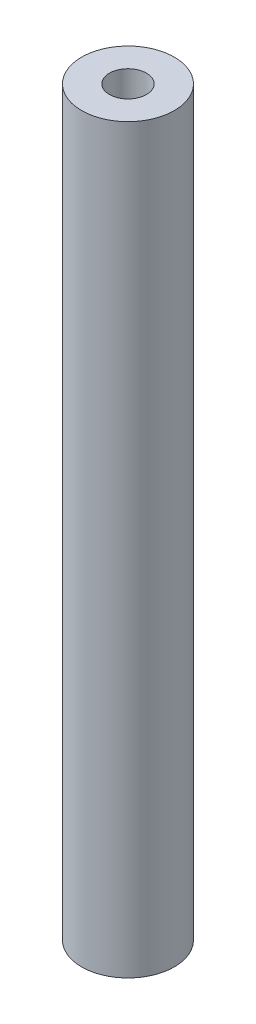
ISO-10303-21;
HEADER;
FILE_DESCRIPTION(('STEP AP214'),'2;1');
FILE_NAME('part.step','',(''),(''),'','','');
FILE_SCHEMA(('AUTOMOTIVE_DESIGN { 1 0 10303 214 1 1 1 1 }'));
ENDSEC;
DATA;
#1=APPLICATION_CONTEXT('core data for automotive mechanical design processes');
#2=APPLICATION_PROTOCOL_DEFINITION('international standard','automotive_design',2000,#1);
#3=PRODUCT_CONTEXT('',#1,'mechanical');
#4=PRODUCT('Part','Part','',(#3));
#5=PRODUCT_RELATED_PRODUCT_CATEGORY('part','',(#4));
#6=PRODUCT_DEFINITION_FORMATION('','',#4);
#7=PRODUCT_DEFINITION_CONTEXT('part definition',#1,'design');
#8=PRODUCT_DEFINITION('design','',#6,#7);
#9=PRODUCT_DEFINITION_SHAPE('','',#8);
#10=(LENGTH_UNIT() NAMED_UNIT(*) SI_UNIT(.MILLI.,.METRE.));
#11=(NAMED_UNIT(*) PLANE_ANGLE_UNIT() SI_UNIT($,.RADIAN.));
#12=(NAMED_UNIT(*) SI_UNIT($,.STERADIAN.) SOLID_ANGLE_UNIT());
#13=UNCERTAINTY_MEASURE_WITH_UNIT(LENGTH_MEASURE(1.E-05),#10,'distance_accuracy_value','');
#14=(GEOMETRIC_REPRESENTATION_CONTEXT(3) GLOBAL_UNCERTAINTY_ASSIGNED_CONTEXT((#13)) GLOBAL_UNIT_ASSIGNED_CONTEXT((#10,
#11,#12)) REPRESENTATION_CONTEXT('',''));
#15=CARTESIAN_POINT('',(0.,0.,0.));
#16=DIRECTION('',(0.,0.,1.));
#17=DIRECTION('',(1.,0.,0.));
#18=AXIS2_PLACEMENT_3D('',#15,#16,#17);
#19=CARTESIAN_POINT('',(0.,40.,0.));
#20=DIRECTION('',(0.,1.,0.));
#21=DIRECTION('',(0.,0.,1.));
#22=AXIS2_PLACEMENT_3D('',#19,#20,#21);
#23=PLANE('',#22);
#24=CARTESIAN_POINT('',(0.,40.,0.));
#25=DIRECTION('',(0.,1.,0.));
#26=DIRECTION('',(0.,0.,1.));
#27=AXIS2_PLACEMENT_3D('',#24,#25,#26);
#28=CIRCLE('',#27,2.5);
#29=CARTESIAN_POINT('',(0.,40.,2.5));
#30=VERTEX_POINT('',#29);
#31=EDGE_CURVE('E10',#30,#30,#28,.T.);
#32=ORIENTED_EDGE('',*,*,#31,.T.);
#33=EDGE_LOOP('',(#32));
#34=FACE_BOUND('',#33,.T.);
#35=CARTESIAN_POINT('',(0.,40.,0.));
#36=DIRECTION('',(0.,1.,0.));
#37=DIRECTION('',(0.,0.,1.));
#38=AXIS2_PLACEMENT_3D('',#35,#36,#37);
#39=CIRCLE('',#38,1.);
#40=CARTESIAN_POINT('',(0.,40.,1.));
#41=VERTEX_POINT('',#40);
#42=EDGE_CURVE('E42',#41,#41,#39,.T.);
#43=ORIENTED_EDGE('',*,*,#42,.F.);
#44=EDGE_LOOP('',(#43));
#45=FACE_BOUND('',#44,.T.);
#46=ADVANCED_FACE('F31',(#34,#45),#23,.T.);
#47=CARTESIAN_POINT('',(0.,0.,0.));
#48=DIRECTION('',(0.,1.,0.));
#49=DIRECTION('',(0.,0.,1.));
#50=AXIS2_PLACEMENT_3D('',#47,#48,#49);
#51=PLANE('',#50);
#52=CARTESIAN_POINT('',(0.,0.,0.));
#53=DIRECTION('',(0.,1.,0.));
#54=DIRECTION('',(0.,0.,1.));
#55=AXIS2_PLACEMENT_3D('',#52,#53,#54);
#56=CIRCLE('',#55,2.5);
#57=CARTESIAN_POINT('',(0.,0.,2.5));
#58=VERTEX_POINT('',#57);
#59=EDGE_CURVE('E35',#58,#58,#56,.T.);
#60=ORIENTED_EDGE('',*,*,#59,.F.);
#61=EDGE_LOOP('',(#60));
#62=FACE_BOUND('',#61,.T.);
#63=CARTESIAN_POINT('',(0.,0.,0.));
#64=DIRECTION('',(0.,1.,0.));
#65=DIRECTION('',(0.,0.,1.));
#66=AXIS2_PLACEMENT_3D('',#63,#64,#65);
#67=CIRCLE('',#66,1.);
#68=CARTESIAN_POINT('',(0.,0.,1.));
#69=VERTEX_POINT('',#68);
#70=EDGE_CURVE('E44',#69,#69,#67,.T.);
#71=ORIENTED_EDGE('',*,*,#70,.T.);
#72=EDGE_LOOP('',(#71));
#73=FACE_BOUND('',#72,.T.);
#74=ADVANCED_FACE('F54',(#62,#73),#51,.F.);
#75=CARTESIAN_POINT('',(0.,40.,0.));
#76=DIRECTION('',(0.,-1.,0.));
#77=DIRECTION('',(0.,0.,-1.));
#78=AXIS2_PLACEMENT_3D('',#75,#76,#77);
#79=CYLINDRICAL_SURFACE('',#78,2.5);
#80=ORIENTED_EDGE('',*,*,#31,.F.);
#81=EDGE_LOOP('',(#80));
#82=FACE_BOUND('',#81,.T.);
#83=ORIENTED_EDGE('',*,*,#59,.T.);
#84=EDGE_LOOP('',(#83));
#85=FACE_BOUND('',#84,.T.);
#86=ADVANCED_FACE('F33',(#82,#85),#79,.T.);
#87=CARTESIAN_POINT('',(0.,40.,0.));
#88=DIRECTION('',(0.,-1.,0.));
#89=DIRECTION('',(0.,0.,-1.));
#90=AXIS2_PLACEMENT_3D('',#87,#88,#89);
#91=CYLINDRICAL_SURFACE('',#90,1.);
#92=ORIENTED_EDGE('',*,*,#42,.T.);
#93=EDGE_LOOP('',(#92));
#94=FACE_BOUND('',#93,.T.);
#95=ORIENTED_EDGE('',*,*,#70,.F.);
#96=EDGE_LOOP('',(#95));
#97=FACE_BOUND('',#96,.T.);
#98=ADVANCED_FACE('F50',(#94,#97),#91,.F.);
#99=CLOSED_SHELL('',(#46,#74,#86,#98));
#100=MANIFOLD_SOLID_BREP('B2',#99);
#101=ADVANCED_BREP_SHAPE_REPRESENTATION('',(#18,#100),#14);
#102=SHAPE_DEFINITION_REPRESENTATION(#9,#101);
ENDSEC;
END-ISO-10303-21;
